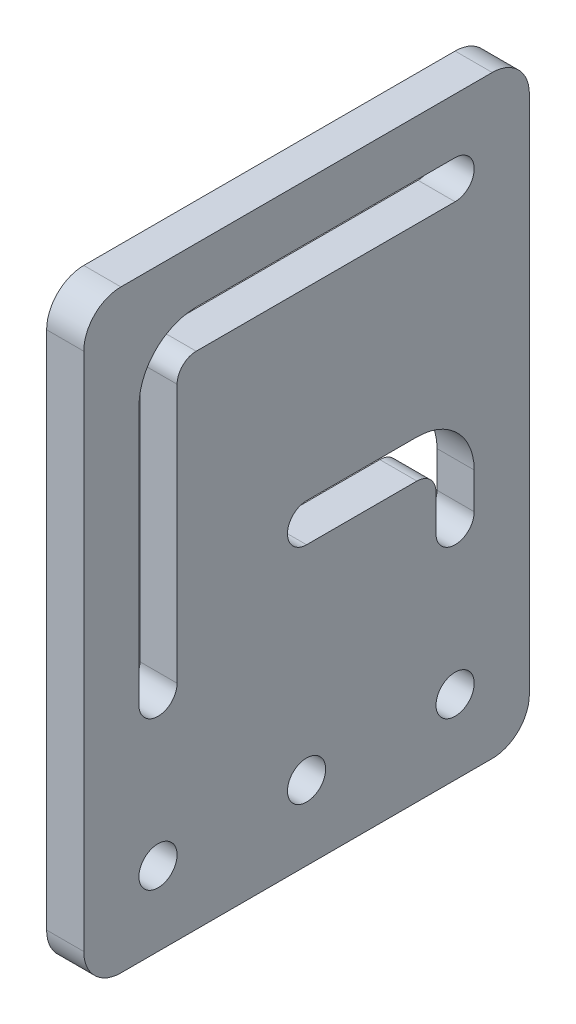
ISO-10303-21;
HEADER;
FILE_DESCRIPTION(('STEP AP214'),'2;1');
FILE_NAME('part.step','',(''),(''),'','','');
FILE_SCHEMA(('AUTOMOTIVE_DESIGN { 1 0 10303 214 1 1 1 1 }'));
ENDSEC;
DATA;
#1=APPLICATION_CONTEXT('core data for automotive mechanical design processes');
#2=APPLICATION_PROTOCOL_DEFINITION('international standard','automotive_design',2000,#1);
#3=PRODUCT_CONTEXT('',#1,'mechanical');
#4=PRODUCT('Part','Part','',(#3));
#5=PRODUCT_RELATED_PRODUCT_CATEGORY('part','',(#4));
#6=PRODUCT_DEFINITION_FORMATION('','',#4);
#7=PRODUCT_DEFINITION_CONTEXT('part definition',#1,'design');
#8=PRODUCT_DEFINITION('design','',#6,#7);
#9=PRODUCT_DEFINITION_SHAPE('','',#8);
#10=(LENGTH_UNIT() NAMED_UNIT(*) SI_UNIT(.MILLI.,.METRE.));
#11=(NAMED_UNIT(*) PLANE_ANGLE_UNIT() SI_UNIT($,.RADIAN.));
#12=(NAMED_UNIT(*) SI_UNIT($,.STERADIAN.) SOLID_ANGLE_UNIT());
#13=UNCERTAINTY_MEASURE_WITH_UNIT(LENGTH_MEASURE(1.E-05),#10,'distance_accuracy_value','');
#14=(GEOMETRIC_REPRESENTATION_CONTEXT(3) GLOBAL_UNCERTAINTY_ASSIGNED_CONTEXT((#13)) GLOBAL_UNIT_ASSIGNED_CONTEXT((#10,
#11,#12)) REPRESENTATION_CONTEXT('',''));
#15=CARTESIAN_POINT('',(0.,0.,0.));
#16=DIRECTION('',(0.,0.,1.));
#17=DIRECTION('',(1.,0.,0.));
#18=AXIS2_PLACEMENT_3D('',#15,#16,#17);
#19=CARTESIAN_POINT('',(6.35,101.6,0.));
#20=DIRECTION('',(-1.,0.,0.));
#21=DIRECTION('',(0.,0.,1.));
#22=AXIS2_PLACEMENT_3D('',#19,#20,#21);
#23=PLANE('',#22);
#24=DIRECTION('',(0.,-1.,0.));
#25=VECTOR('',#24,1.);
#26=CARTESIAN_POINT('',(6.35,47.5360999999999,-60.2360999999999));
#27=LINE('',#26,#25);
#28=CARTESIAN_POINT('',(6.35,44.2721999999999,-60.2360999999999));
#29=VERTEX_POINT('',#28);
#30=CARTESIAN_POINT('',(6.35,38.0999999999999,-60.2360999999999));
#31=VERTEX_POINT('',#30);
#32=EDGE_CURVE('E268',#29,#31,#27,.T.);
#33=ORIENTED_EDGE('',*,*,#32,.F.);
#34=CARTESIAN_POINT('',(6.35,44.2721999999999,-56.9721999999999));
#35=DIRECTION('',(-1.,0.,0.));
#36=DIRECTION('',(0.,0.,1.));
#37=AXIS2_PLACEMENT_3D('',#34,#35,#36);
#38=CIRCLE('',#37,3.2639);
#39=CARTESIAN_POINT('',(6.35,47.5360999999999,-56.9721999999999));
#40=VERTEX_POINT('',#39);
#41=EDGE_CURVE('E334',#29,#40,#38,.F.);
#42=ORIENTED_EDGE('',*,*,#41,.T.);
#43=DIRECTION('',(0.,0.,-1.));
#44=VECTOR('',#43,1.);
#45=CARTESIAN_POINT('',(6.35,47.5361,-38.1));
#46=LINE('',#45,#44);
#47=CARTESIAN_POINT('',(6.35,47.5361,-38.1));
#48=VERTEX_POINT('',#47);
#49=EDGE_CURVE('E265',#48,#40,#46,.T.);
#50=ORIENTED_EDGE('',*,*,#49,.F.);
#51=CARTESIAN_POINT('',(6.35,50.8,-38.1));
#52=DIRECTION('',(1.,0.,0.));
#53=DIRECTION('',(0.,0.,-1.));
#54=AXIS2_PLACEMENT_3D('',#51,#52,#53);
#55=CIRCLE('',#54,3.2639);
#56=CARTESIAN_POINT('',(6.35,54.0639,-38.1));
#57=VERTEX_POINT('',#56);
#58=EDGE_CURVE('E263',#57,#48,#55,.T.);
#59=ORIENTED_EDGE('',*,*,#58,.F.);
#60=DIRECTION('',(0.,0.,1.));
#61=VECTOR('',#60,1.);
#62=CARTESIAN_POINT('',(6.35,54.0639,-38.1));
#63=LINE('',#62,#61);
#64=CARTESIAN_POINT('',(6.35,54.0638999999999,-56.9721999999999));
#65=VERTEX_POINT('',#64);
#66=EDGE_CURVE('E275',#65,#57,#63,.T.);
#67=ORIENTED_EDGE('',*,*,#66,.F.);
#68=CARTESIAN_POINT('',(6.35,44.2721999999999,-56.9721999999999));
#69=DIRECTION('',(-1.,0.,0.));
#70=DIRECTION('',(0.,0.,1.));
#71=AXIS2_PLACEMENT_3D('',#68,#69,#70);
#72=CIRCLE('',#71,9.7917);
#73=CARTESIAN_POINT('',(6.35,44.2721999999999,-66.7638999999999));
#74=VERTEX_POINT('',#73);
#75=EDGE_CURVE('E359',#65,#74,#72,.T.);
#76=ORIENTED_EDGE('',*,*,#75,.T.);
#77=DIRECTION('',(0.,1.,0.));
#78=VECTOR('',#77,1.);
#79=CARTESIAN_POINT('',(6.35,54.0638999999999,-66.7638999999999));
#80=LINE('',#79,#78);
#81=CARTESIAN_POINT('',(6.35,38.0999999999999,-66.7638999999999));
#82=VERTEX_POINT('',#81);
#83=EDGE_CURVE('E272',#82,#74,#80,.T.);
#84=ORIENTED_EDGE('',*,*,#83,.F.);
#85=CARTESIAN_POINT('',(6.35,38.1,-63.4999999999999));
#86=DIRECTION('',(1.,0.,0.));
#87=DIRECTION('',(0.,0.,-1.));
#88=AXIS2_PLACEMENT_3D('',#85,#86,#87);
#89=CIRCLE('',#88,3.26389999999998);
#90=EDGE_CURVE('E270',#31,#82,#89,.T.);
#91=ORIENTED_EDGE('',*,*,#90,.F.);
#92=EDGE_LOOP('',(#33,#42,#50,#59,#67,#76,#84,#91));
#93=FACE_BOUND('',#92,.T.);
#94=CARTESIAN_POINT('',(6.35,12.7,-38.1));
#95=DIRECTION('',(1.,0.,0.));
#96=DIRECTION('',(0.,0.,-1.));
#97=AXIS2_PLACEMENT_3D('',#94,#95,#96);
#98=CIRCLE('',#97,3.26390000000002);
#99=CARTESIAN_POINT('',(6.35,12.7,-41.3639));
#100=VERTEX_POINT('',#99);
#101=EDGE_CURVE('E297',#100,#100,#98,.T.);
#102=ORIENTED_EDGE('',*,*,#101,.F.);
#103=EDGE_LOOP('',(#102));
#104=FACE_BOUND('',#103,.T.);
#105=DIRECTION('',(0.,-1.,0.));
#106=VECTOR('',#105,1.);
#107=CARTESIAN_POINT('',(6.35,0.,0.));
#108=LINE('',#107,#106);
#109=CARTESIAN_POINT('',(6.35,95.25,0.));
#110=VERTEX_POINT('',#109);
#111=CARTESIAN_POINT('',(6.35,6.35,0.));
#112=VERTEX_POINT('',#111);
#113=EDGE_CURVE('E317',#110,#112,#108,.T.);
#114=ORIENTED_EDGE('',*,*,#113,.T.);
#115=CARTESIAN_POINT('',(6.35,6.35,-6.35));
#116=DIRECTION('',(-1.,0.,0.));
#117=DIRECTION('',(0.,0.,1.));
#118=AXIS2_PLACEMENT_3D('',#115,#116,#117);
#119=CIRCLE('',#118,6.35);
#120=CARTESIAN_POINT('',(6.35,0.,-6.35));
#121=VERTEX_POINT('',#120);
#122=EDGE_CURVE('E384',#112,#121,#119,.F.);
#123=ORIENTED_EDGE('',*,*,#122,.T.);
#124=DIRECTION('',(0.,0.,-1.));
#125=VECTOR('',#124,1.);
#126=CARTESIAN_POINT('',(6.35,0.,0.));
#127=LINE('',#126,#125);
#128=CARTESIAN_POINT('',(6.35,0.,-69.85));
#129=VERTEX_POINT('',#128);
#130=EDGE_CURVE('E320',#121,#129,#127,.T.);
#131=ORIENTED_EDGE('',*,*,#130,.T.);
#132=CARTESIAN_POINT('',(6.35,6.35,-69.85));
#133=DIRECTION('',(-1.,0.,0.));
#134=DIRECTION('',(0.,0.,1.));
#135=AXIS2_PLACEMENT_3D('',#132,#133,#134);
#136=CIRCLE('',#135,6.35);
#137=CARTESIAN_POINT('',(6.35,6.35,-76.2));
#138=VERTEX_POINT('',#137);
#139=EDGE_CURVE('E382',#129,#138,#136,.F.);
#140=ORIENTED_EDGE('',*,*,#139,.T.);
#141=DIRECTION('',(0.,1.,0.));
#142=VECTOR('',#141,1.);
#143=CARTESIAN_POINT('',(6.35,0.,-76.2));
#144=LINE('',#143,#142);
#145=CARTESIAN_POINT('',(6.35,95.25,-76.2));
#146=VERTEX_POINT('',#145);
#147=EDGE_CURVE('E323',#138,#146,#144,.T.);
#148=ORIENTED_EDGE('',*,*,#147,.T.);
#149=CARTESIAN_POINT('',(6.35,95.25,-69.85));
#150=DIRECTION('',(-1.,0.,0.));
#151=DIRECTION('',(0.,0.,1.));
#152=AXIS2_PLACEMENT_3D('',#149,#150,#151);
#153=CIRCLE('',#152,6.35);
#154=CARTESIAN_POINT('',(6.35,101.6,-69.85));
#155=VERTEX_POINT('',#154);
#156=EDGE_CURVE('E52',#146,#155,#153,.F.);
#157=ORIENTED_EDGE('',*,*,#156,.T.);
#158=DIRECTION('',(0.,0.,1.));
#159=VECTOR('',#158,1.);
#160=CARTESIAN_POINT('',(6.35,101.6,0.));
#161=LINE('',#160,#159);
#162=CARTESIAN_POINT('',(6.35,101.6,-6.34999999999999));
#163=VERTEX_POINT('',#162);
#164=EDGE_CURVE('E325',#155,#163,#161,.T.);
#165=ORIENTED_EDGE('',*,*,#164,.T.);
#166=CARTESIAN_POINT('',(6.35,95.25,-6.34999999999999));
#167=DIRECTION('',(-1.,0.,0.));
#168=DIRECTION('',(0.,0.,1.));
#169=AXIS2_PLACEMENT_3D('',#166,#167,#168);
#170=CIRCLE('',#169,6.35);
#171=EDGE_CURVE('E379',#163,#110,#170,.F.);
#172=ORIENTED_EDGE('',*,*,#171,.T.);
#173=EDGE_LOOP('',(#114,#123,#131,#140,#148,#157,#165,#172));
#174=FACE_BOUND('',#173,.T.);
#175=CARTESIAN_POINT('',(6.35,12.7,-12.7));
#176=DIRECTION('',(1.,0.,0.));
#177=DIRECTION('',(0.,0.,-1.));
#178=AXIS2_PLACEMENT_3D('',#175,#176,#177);
#179=CIRCLE('',#178,3.2639);
#180=CARTESIAN_POINT('',(6.35,12.7,-15.9639));
#181=VERTEX_POINT('',#180);
#182=EDGE_CURVE('E303',#181,#181,#179,.T.);
#183=ORIENTED_EDGE('',*,*,#182,.F.);
#184=EDGE_LOOP('',(#183));
#185=FACE_BOUND('',#184,.T.);
#186=CARTESIAN_POINT('',(6.35,12.7,-63.5));
#187=DIRECTION('',(1.,0.,0.));
#188=DIRECTION('',(0.,0.,-1.));
#189=AXIS2_PLACEMENT_3D('',#186,#187,#188);
#190=CIRCLE('',#189,3.26389999999999);
#191=CARTESIAN_POINT('',(6.35,12.7,-66.7639));
#192=VERTEX_POINT('',#191);
#193=EDGE_CURVE('E291',#192,#192,#190,.T.);
#194=ORIENTED_EDGE('',*,*,#193,.F.);
#195=EDGE_LOOP('',(#194));
#196=FACE_BOUND('',#195,.T.);
#197=DIRECTION('',(0.,0.,-1.));
#198=VECTOR('',#197,1.);
#199=CARTESIAN_POINT('',(6.35,85.6360999999999,-15.9639));
#200=LINE('',#199,#198);
#201=CARTESIAN_POINT('',(6.35,85.6360999999999,-19.2278));
#202=VERTEX_POINT('',#201);
#203=CARTESIAN_POINT('',(6.35,85.6360999999999,-63.5));
#204=VERTEX_POINT('',#203);
#205=EDGE_CURVE('E233',#202,#204,#200,.T.);
#206=ORIENTED_EDGE('',*,*,#205,.F.);
#207=CARTESIAN_POINT('',(6.35,82.3721999999999,-19.2278));
#208=DIRECTION('',(-1.,0.,0.));
#209=DIRECTION('',(0.,0.,1.));
#210=AXIS2_PLACEMENT_3D('',#207,#208,#209);
#211=CIRCLE('',#210,3.2639);
#212=CARTESIAN_POINT('',(6.35,82.3721999999999,-15.9639));
#213=VERTEX_POINT('',#212);
#214=EDGE_CURVE('E336',#202,#213,#211,.F.);
#215=ORIENTED_EDGE('',*,*,#214,.T.);
#216=DIRECTION('',(0.,1.,0.));
#217=VECTOR('',#216,1.);
#218=CARTESIAN_POINT('',(6.35,38.1,-15.9639));
#219=LINE('',#218,#217);
#220=CARTESIAN_POINT('',(6.35,38.1,-15.9639));
#221=VERTEX_POINT('',#220);
#222=EDGE_CURVE('E231',#221,#213,#219,.T.);
#223=ORIENTED_EDGE('',*,*,#222,.F.);
#224=CARTESIAN_POINT('',(6.35,38.1,-12.7));
#225=DIRECTION('',(1.,0.,0.));
#226=DIRECTION('',(0.,0.,-1.));
#227=AXIS2_PLACEMENT_3D('',#224,#225,#226);
#228=CIRCLE('',#227,3.2639);
#229=CARTESIAN_POINT('',(6.35,38.1,-9.43610000000004));
#230=VERTEX_POINT('',#229);
#231=EDGE_CURVE('E213',#230,#221,#228,.T.);
#232=ORIENTED_EDGE('',*,*,#231,.F.);
#233=DIRECTION('',(0.,-1.,0.));
#234=VECTOR('',#233,1.);
#235=CARTESIAN_POINT('',(6.35,38.1,-9.43610000000004));
#236=LINE('',#235,#234);
#237=CARTESIAN_POINT('',(6.35,82.3721999999999,-9.43610000000004));
#238=VERTEX_POINT('',#237);
#239=EDGE_CURVE('E240',#238,#230,#236,.T.);
#240=ORIENTED_EDGE('',*,*,#239,.F.);
#241=CARTESIAN_POINT('',(6.35,82.3721999999999,-19.2278));
#242=DIRECTION('',(-1.,0.,0.));
#243=DIRECTION('',(0.,0.,1.));
#244=AXIS2_PLACEMENT_3D('',#241,#242,#243);
#245=CIRCLE('',#244,9.7917);
#246=CARTESIAN_POINT('',(6.35,92.1638999999999,-19.2278));
#247=VERTEX_POINT('',#246);
#248=EDGE_CURVE('E355',#238,#247,#245,.T.);
#249=ORIENTED_EDGE('',*,*,#248,.T.);
#250=DIRECTION('',(0.,0.,1.));
#251=VECTOR('',#250,1.);
#252=CARTESIAN_POINT('',(6.35,92.1638999999999,-9.43610000000004));
#253=LINE('',#252,#251);
#254=CARTESIAN_POINT('',(6.35,92.1638999999999,-63.4999999999999));
#255=VERTEX_POINT('',#254);
#256=EDGE_CURVE('E237',#255,#247,#253,.T.);
#257=ORIENTED_EDGE('',*,*,#256,.F.);
#258=CARTESIAN_POINT('',(6.35,88.8999999999999,-63.4999999999999));
#259=DIRECTION('',(1.,0.,0.));
#260=DIRECTION('',(0.,0.,-1.));
#261=AXIS2_PLACEMENT_3D('',#258,#259,#260);
#262=CIRCLE('',#261,3.26389999999999);
#263=EDGE_CURVE('E235',#204,#255,#262,.T.);
#264=ORIENTED_EDGE('',*,*,#263,.F.);
#265=EDGE_LOOP('',(#206,#215,#223,#232,#240,#249,#257,#264));
#266=FACE_BOUND('',#265,.T.);
#267=ADVANCED_FACE('F31',(#93,#104,#174,#185,#196,#266),#23,.F.);
#268=CARTESIAN_POINT('',(0.,101.6,0.));
#269=DIRECTION('',(-1.,0.,0.));
#270=DIRECTION('',(0.,0.,1.));
#271=AXIS2_PLACEMENT_3D('',#268,#269,#270);
#272=PLANE('',#271);
#273=DIRECTION('',(0.,0.,-1.));
#274=VECTOR('',#273,1.);
#275=CARTESIAN_POINT('',(0.,47.5361,-38.1));
#276=LINE('',#275,#274);
#277=CARTESIAN_POINT('',(0.,47.5361,-38.1));
#278=VERTEX_POINT('',#277);
#279=CARTESIAN_POINT('',(0.,47.5360999999999,-56.9721999999999));
#280=VERTEX_POINT('',#279);
#281=EDGE_CURVE('E250',#278,#280,#276,.T.);
#282=ORIENTED_EDGE('',*,*,#281,.T.);
#283=CARTESIAN_POINT('',(0.,44.2721999999999,-56.9721999999999));
#284=DIRECTION('',(-1.,0.,0.));
#285=DIRECTION('',(0.,0.,1.));
#286=AXIS2_PLACEMENT_3D('',#283,#284,#285);
#287=CIRCLE('',#286,3.2639);
#288=CARTESIAN_POINT('',(0.,44.2721999999999,-60.2360999999999));
#289=VERTEX_POINT('',#288);
#290=EDGE_CURVE('E328',#280,#289,#287,.T.);
#291=ORIENTED_EDGE('',*,*,#290,.T.);
#292=DIRECTION('',(0.,-1.,0.));
#293=VECTOR('',#292,1.);
#294=CARTESIAN_POINT('',(0.,47.5360999999999,-60.2360999999999));
#295=LINE('',#294,#293);
#296=CARTESIAN_POINT('',(0.,38.0999999999999,-60.2360999999999));
#297=VERTEX_POINT('',#296);
#298=EDGE_CURVE('E253',#289,#297,#295,.T.);
#299=ORIENTED_EDGE('',*,*,#298,.T.);
#300=CARTESIAN_POINT('',(0.,38.1,-63.4999999999999));
#301=DIRECTION('',(1.,0.,0.));
#302=DIRECTION('',(0.,0.,-1.));
#303=AXIS2_PLACEMENT_3D('',#300,#301,#302);
#304=CIRCLE('',#303,3.26389999999998);
#305=CARTESIAN_POINT('',(0.,38.0999999999999,-66.7638999999999));
#306=VERTEX_POINT('',#305);
#307=EDGE_CURVE('E255',#297,#306,#304,.T.);
#308=ORIENTED_EDGE('',*,*,#307,.T.);
#309=DIRECTION('',(0.,1.,0.));
#310=VECTOR('',#309,1.);
#311=CARTESIAN_POINT('',(0.,54.0638999999999,-66.7638999999999));
#312=LINE('',#311,#310);
#313=CARTESIAN_POINT('',(0.,44.2721999999999,-66.7638999999999));
#314=VERTEX_POINT('',#313);
#315=EDGE_CURVE('E258',#306,#314,#312,.T.);
#316=ORIENTED_EDGE('',*,*,#315,.T.);
#317=CARTESIAN_POINT('',(0.,44.2721999999999,-56.9721999999999));
#318=DIRECTION('',(-1.,0.,0.));
#319=DIRECTION('',(0.,0.,1.));
#320=AXIS2_PLACEMENT_3D('',#317,#318,#319);
#321=CIRCLE('',#320,9.7917);
#322=CARTESIAN_POINT('',(0.,54.0638999999999,-56.9721999999999));
#323=VERTEX_POINT('',#322);
#324=EDGE_CURVE('E357',#314,#323,#321,.F.);
#325=ORIENTED_EDGE('',*,*,#324,.T.);
#326=DIRECTION('',(0.,0.,1.));
#327=VECTOR('',#326,1.);
#328=CARTESIAN_POINT('',(0.,54.0639,-38.1));
#329=LINE('',#328,#327);
#330=CARTESIAN_POINT('',(0.,54.0639,-38.1));
#331=VERTEX_POINT('',#330);
#332=EDGE_CURVE('E261',#323,#331,#329,.T.);
#333=ORIENTED_EDGE('',*,*,#332,.T.);
#334=CARTESIAN_POINT('',(0.,50.8,-38.1));
#335=DIRECTION('',(1.,0.,0.));
#336=DIRECTION('',(0.,0.,-1.));
#337=AXIS2_PLACEMENT_3D('',#334,#335,#336);
#338=CIRCLE('',#337,3.2639);
#339=EDGE_CURVE('E214',#331,#278,#338,.T.);
#340=ORIENTED_EDGE('',*,*,#339,.T.);
#341=EDGE_LOOP('',(#282,#291,#299,#308,#316,#325,#333,#340));
#342=FACE_BOUND('',#341,.T.);
#343=CARTESIAN_POINT('',(0.,12.7,-38.1));
#344=DIRECTION('',(1.,0.,0.));
#345=DIRECTION('',(0.,0.,-1.));
#346=AXIS2_PLACEMENT_3D('',#343,#344,#345);
#347=CIRCLE('',#346,3.26390000000002);
#348=CARTESIAN_POINT('',(0.,12.7,-41.3639));
#349=VERTEX_POINT('',#348);
#350=EDGE_CURVE('E294',#349,#349,#347,.T.);
#351=ORIENTED_EDGE('',*,*,#350,.T.);
#352=EDGE_LOOP('',(#351));
#353=FACE_BOUND('',#352,.T.);
#354=DIRECTION('',(0.,0.,-1.));
#355=VECTOR('',#354,1.);
#356=CARTESIAN_POINT('',(0.,0.,0.));
#357=LINE('',#356,#355);
#358=CARTESIAN_POINT('',(0.,0.,-6.35));
#359=VERTEX_POINT('',#358);
#360=CARTESIAN_POINT('',(0.,0.,-69.85));
#361=VERTEX_POINT('',#360);
#362=EDGE_CURVE('E309',#359,#361,#357,.T.);
#363=ORIENTED_EDGE('',*,*,#362,.F.);
#364=CARTESIAN_POINT('',(0.,6.35,-6.35));
#365=DIRECTION('',(-1.,0.,0.));
#366=DIRECTION('',(0.,0.,1.));
#367=AXIS2_PLACEMENT_3D('',#364,#365,#366);
#368=CIRCLE('',#367,6.35);
#369=CARTESIAN_POINT('',(0.,6.35,0.));
#370=VERTEX_POINT('',#369);
#371=EDGE_CURVE('E372',#359,#370,#368,.T.);
#372=ORIENTED_EDGE('',*,*,#371,.T.);
#373=DIRECTION('',(0.,-1.,0.));
#374=VECTOR('',#373,1.);
#375=CARTESIAN_POINT('',(0.,0.,0.));
#376=LINE('',#375,#374);
#377=CARTESIAN_POINT('',(0.,95.25,0.));
#378=VERTEX_POINT('',#377);
#379=EDGE_CURVE('E306',#378,#370,#376,.T.);
#380=ORIENTED_EDGE('',*,*,#379,.F.);
#381=CARTESIAN_POINT('',(0.,95.25,-6.34999999999999));
#382=DIRECTION('',(-1.,0.,0.));
#383=DIRECTION('',(0.,0.,1.));
#384=AXIS2_PLACEMENT_3D('',#381,#382,#383);
#385=CIRCLE('',#384,6.35);
#386=CARTESIAN_POINT('',(0.,101.6,-6.34999999999999));
#387=VERTEX_POINT('',#386);
#388=EDGE_CURVE('E366',#378,#387,#385,.T.);
#389=ORIENTED_EDGE('',*,*,#388,.T.);
#390=DIRECTION('',(0.,0.,1.));
#391=VECTOR('',#390,1.);
#392=CARTESIAN_POINT('',(0.,101.6,0.));
#393=LINE('',#392,#391);
#394=CARTESIAN_POINT('',(0.,101.6,-69.85));
#395=VERTEX_POINT('',#394);
#396=EDGE_CURVE('E315',#395,#387,#393,.T.);
#397=ORIENTED_EDGE('',*,*,#396,.F.);
#398=CARTESIAN_POINT('',(0.,95.25,-69.85));
#399=DIRECTION('',(-1.,0.,0.));
#400=DIRECTION('',(0.,0.,1.));
#401=AXIS2_PLACEMENT_3D('',#398,#399,#400);
#402=CIRCLE('',#401,6.35);
#403=CARTESIAN_POINT('',(0.,95.25,-76.2));
#404=VERTEX_POINT('',#403);
#405=EDGE_CURVE('E368',#395,#404,#402,.T.);
#406=ORIENTED_EDGE('',*,*,#405,.T.);
#407=DIRECTION('',(0.,1.,0.));
#408=VECTOR('',#407,1.);
#409=CARTESIAN_POINT('',(0.,0.,-76.2));
#410=LINE('',#409,#408);
#411=CARTESIAN_POINT('',(0.,6.35,-76.2));
#412=VERTEX_POINT('',#411);
#413=EDGE_CURVE('E312',#412,#404,#410,.T.);
#414=ORIENTED_EDGE('',*,*,#413,.F.);
#415=CARTESIAN_POINT('',(0.,6.35,-69.85));
#416=DIRECTION('',(-1.,0.,0.));
#417=DIRECTION('',(0.,0.,1.));
#418=AXIS2_PLACEMENT_3D('',#415,#416,#417);
#419=CIRCLE('',#418,6.35);
#420=EDGE_CURVE('E370',#412,#361,#419,.T.);
#421=ORIENTED_EDGE('',*,*,#420,.T.);
#422=EDGE_LOOP('',(#363,#372,#380,#389,#397,#406,#414,#421));
#423=FACE_BOUND('',#422,.T.);
#424=CARTESIAN_POINT('',(0.,12.7,-12.7));
#425=DIRECTION('',(1.,0.,0.));
#426=DIRECTION('',(0.,0.,-1.));
#427=AXIS2_PLACEMENT_3D('',#424,#425,#426);
#428=CIRCLE('',#427,3.2639);
#429=CARTESIAN_POINT('',(0.,12.7,-15.9639));
#430=VERTEX_POINT('',#429);
#431=EDGE_CURVE('E300',#430,#430,#428,.T.);
#432=ORIENTED_EDGE('',*,*,#431,.T.);
#433=EDGE_LOOP('',(#432));
#434=FACE_BOUND('',#433,.T.);
#435=CARTESIAN_POINT('',(0.,12.7,-63.5));
#436=DIRECTION('',(1.,0.,0.));
#437=DIRECTION('',(0.,0.,-1.));
#438=AXIS2_PLACEMENT_3D('',#435,#436,#437);
#439=CIRCLE('',#438,3.26389999999999);
#440=CARTESIAN_POINT('',(0.,12.7,-66.7639));
#441=VERTEX_POINT('',#440);
#442=EDGE_CURVE('E288',#441,#441,#439,.T.);
#443=ORIENTED_EDGE('',*,*,#442,.T.);
#444=EDGE_LOOP('',(#443));
#445=FACE_BOUND('',#444,.T.);
#446=DIRECTION('',(0.,1.,0.));
#447=VECTOR('',#446,1.);
#448=CARTESIAN_POINT('',(0.,38.1,-15.9639));
#449=LINE('',#448,#447);
#450=CARTESIAN_POINT('',(0.,38.1,-15.9639));
#451=VERTEX_POINT('',#450);
#452=CARTESIAN_POINT('',(0.,82.3721999999999,-15.9639));
#453=VERTEX_POINT('',#452);
#454=EDGE_CURVE('E194',#451,#453,#449,.T.);
#455=ORIENTED_EDGE('',*,*,#454,.T.);
#456=CARTESIAN_POINT('',(0.,82.3721999999999,-19.2278));
#457=DIRECTION('',(-1.,0.,0.));
#458=DIRECTION('',(0.,0.,1.));
#459=AXIS2_PLACEMENT_3D('',#456,#457,#458);
#460=CIRCLE('',#459,3.2639);
#461=CARTESIAN_POINT('',(0.,85.6360999999999,-19.2278));
#462=VERTEX_POINT('',#461);
#463=EDGE_CURVE('E330',#453,#462,#460,.T.);
#464=ORIENTED_EDGE('',*,*,#463,.T.);
#465=DIRECTION('',(0.,0.,-1.));
#466=VECTOR('',#465,1.);
#467=CARTESIAN_POINT('',(0.,85.6360999999999,-15.9639));
#468=LINE('',#467,#466);
#469=CARTESIAN_POINT('',(0.,85.6360999999999,-63.5));
#470=VERTEX_POINT('',#469);
#471=EDGE_CURVE('E204',#462,#470,#468,.T.);
#472=ORIENTED_EDGE('',*,*,#471,.T.);
#473=CARTESIAN_POINT('',(0.,88.8999999999999,-63.4999999999999));
#474=DIRECTION('',(1.,0.,0.));
#475=DIRECTION('',(0.,0.,-1.));
#476=AXIS2_PLACEMENT_3D('',#473,#474,#475);
#477=CIRCLE('',#476,3.26389999999999);
#478=CARTESIAN_POINT('',(0.,92.1638999999999,-63.4999999999999));
#479=VERTEX_POINT('',#478);
#480=EDGE_CURVE('E223',#470,#479,#477,.T.);
#481=ORIENTED_EDGE('',*,*,#480,.T.);
#482=DIRECTION('',(0.,0.,1.));
#483=VECTOR('',#482,1.);
#484=CARTESIAN_POINT('',(0.,92.1638999999999,-9.43610000000004));
#485=LINE('',#484,#483);
#486=CARTESIAN_POINT('',(0.,92.1638999999999,-19.2278));
#487=VERTEX_POINT('',#486);
#488=EDGE_CURVE('E226',#479,#487,#485,.T.);
#489=ORIENTED_EDGE('',*,*,#488,.T.);
#490=CARTESIAN_POINT('',(0.,82.3721999999999,-19.2278));
#491=DIRECTION('',(-1.,0.,0.));
#492=DIRECTION('',(0.,0.,1.));
#493=AXIS2_PLACEMENT_3D('',#490,#491,#492);
#494=CIRCLE('',#493,9.7917);
#495=CARTESIAN_POINT('',(0.,82.3721999999999,-9.43610000000004));
#496=VERTEX_POINT('',#495);
#497=EDGE_CURVE('E353',#487,#496,#494,.F.);
#498=ORIENTED_EDGE('',*,*,#497,.T.);
#499=DIRECTION('',(0.,-1.,0.));
#500=VECTOR('',#499,1.);
#501=CARTESIAN_POINT('',(0.,38.1,-9.43610000000004));
#502=LINE('',#501,#500);
#503=CARTESIAN_POINT('',(0.,38.1,-9.43610000000004));
#504=VERTEX_POINT('',#503);
#505=EDGE_CURVE('E219',#496,#504,#502,.T.);
#506=ORIENTED_EDGE('',*,*,#505,.T.);
#507=CARTESIAN_POINT('',(0.,38.1,-12.7));
#508=DIRECTION('',(1.,0.,0.));
#509=DIRECTION('',(0.,0.,-1.));
#510=AXIS2_PLACEMENT_3D('',#507,#508,#509);
#511=CIRCLE('',#510,3.2639);
#512=EDGE_CURVE('E205',#504,#451,#511,.T.);
#513=ORIENTED_EDGE('',*,*,#512,.T.);
#514=EDGE_LOOP('',(#455,#464,#472,#481,#489,#498,#506,#513));
#515=FACE_BOUND('',#514,.T.);
#516=ADVANCED_FACE('F217',(#342,#353,#423,#434,#445,#515),#272,.T.);
#517=CARTESIAN_POINT('',(6.35,0.,0.));
#518=DIRECTION('',(0.,0.,-1.));
#519=DIRECTION('',(0.,1.,0.));
#520=AXIS2_PLACEMENT_3D('',#517,#518,#519);
#521=PLANE('',#520);
#522=ORIENTED_EDGE('',*,*,#379,.T.);
#523=DIRECTION('',(-1.,0.,0.));
#524=VECTOR('',#523,1.);
#525=CARTESIAN_POINT('',(6.35,6.35,0.));
#526=LINE('',#525,#524);
#527=EDGE_CURVE('E377',#370,#112,#526,.F.);
#528=ORIENTED_EDGE('',*,*,#527,.T.);
#529=ORIENTED_EDGE('',*,*,#113,.F.);
#530=DIRECTION('',(-1.,0.,0.));
#531=VECTOR('',#530,1.);
#532=CARTESIAN_POINT('',(6.35,95.25,0.));
#533=LINE('',#532,#531);
#534=EDGE_CURVE('E374',#110,#378,#533,.T.);
#535=ORIENTED_EDGE('',*,*,#534,.T.);
#536=EDGE_LOOP('',(#522,#528,#529,#535));
#537=FACE_BOUND('',#536,.T.);
#538=ADVANCED_FACE('F33',(#537),#521,.F.);
#539=CARTESIAN_POINT('',(6.35,0.,0.));
#540=DIRECTION('',(0.,1.,0.));
#541=DIRECTION('',(0.,0.,1.));
#542=AXIS2_PLACEMENT_3D('',#539,#540,#541);
#543=PLANE('',#542);
#544=ORIENTED_EDGE('',*,*,#130,.F.);
#545=DIRECTION('',(-1.,0.,0.));
#546=VECTOR('',#545,1.);
#547=CARTESIAN_POINT('',(6.35,0.,-6.35));
#548=LINE('',#547,#546);
#549=EDGE_CURVE('E363',#121,#359,#548,.T.);
#550=ORIENTED_EDGE('',*,*,#549,.T.);
#551=ORIENTED_EDGE('',*,*,#362,.T.);
#552=DIRECTION('',(-1.,0.,0.));
#553=VECTOR('',#552,1.);
#554=CARTESIAN_POINT('',(6.35,0.,-69.85));
#555=LINE('',#554,#553);
#556=EDGE_CURVE('E361',#361,#129,#555,.F.);
#557=ORIENTED_EDGE('',*,*,#556,.T.);
#558=EDGE_LOOP('',(#544,#550,#551,#557));
#559=FACE_BOUND('',#558,.T.);
#560=ADVANCED_FACE('F421',(#559),#543,.F.);
#561=CARTESIAN_POINT('',(6.35,0.,-76.2));
#562=DIRECTION('',(0.,0.,1.));
#563=DIRECTION('',(1.,0.,0.));
#564=AXIS2_PLACEMENT_3D('',#561,#562,#563);
#565=PLANE('',#564);
#566=ORIENTED_EDGE('',*,*,#147,.F.);
#567=DIRECTION('',(-1.,0.,0.));
#568=VECTOR('',#567,1.);
#569=CARTESIAN_POINT('',(6.35,6.35,-76.2));
#570=LINE('',#569,#568);
#571=EDGE_CURVE('E388',#138,#412,#570,.T.);
#572=ORIENTED_EDGE('',*,*,#571,.T.);
#573=ORIENTED_EDGE('',*,*,#413,.T.);
#574=DIRECTION('',(-1.,0.,0.));
#575=VECTOR('',#574,1.);
#576=CARTESIAN_POINT('',(6.35,95.25,-76.2));
#577=LINE('',#576,#575);
#578=EDGE_CURVE('E386',#404,#146,#577,.F.);
#579=ORIENTED_EDGE('',*,*,#578,.T.);
#580=EDGE_LOOP('',(#566,#572,#573,#579));
#581=FACE_BOUND('',#580,.T.);
#582=ADVANCED_FACE('F394',(#581),#565,.F.);
#583=CARTESIAN_POINT('',(6.35,101.6,0.));
#584=DIRECTION('',(0.,-1.,0.));
#585=DIRECTION('',(0.,0.,-1.));
#586=AXIS2_PLACEMENT_3D('',#583,#584,#585);
#587=PLANE('',#586);
#588=ORIENTED_EDGE('',*,*,#164,.F.);
#589=DIRECTION('',(-1.,0.,0.));
#590=VECTOR('',#589,1.);
#591=CARTESIAN_POINT('',(6.35,101.6,-69.85));
#592=LINE('',#591,#590);
#593=EDGE_CURVE('E11',#155,#395,#592,.T.);
#594=ORIENTED_EDGE('',*,*,#593,.T.);
#595=ORIENTED_EDGE('',*,*,#396,.T.);
#596=DIRECTION('',(-1.,0.,0.));
#597=VECTOR('',#596,1.);
#598=CARTESIAN_POINT('',(6.35,101.6,-6.34999999999999));
#599=LINE('',#598,#597);
#600=EDGE_CURVE('E39',#387,#163,#599,.F.);
#601=ORIENTED_EDGE('',*,*,#600,.T.);
#602=EDGE_LOOP('',(#588,#594,#595,#601));
#603=FACE_BOUND('',#602,.T.);
#604=ADVANCED_FACE('F405',(#603),#587,.F.);
#605=CARTESIAN_POINT('',(6.35,12.7,-12.7));
#606=DIRECTION('',(-1.,0.,0.));
#607=DIRECTION('',(0.,0.,1.));
#608=AXIS2_PLACEMENT_3D('',#605,#606,#607);
#609=CYLINDRICAL_SURFACE('',#608,3.2639);
#610=ORIENTED_EDGE('',*,*,#182,.T.);
#611=EDGE_LOOP('',(#610));
#612=FACE_BOUND('',#611,.T.);
#613=ORIENTED_EDGE('',*,*,#431,.F.);
#614=EDGE_LOOP('',(#613));
#615=FACE_BOUND('',#614,.T.);
#616=ADVANCED_FACE('F447',(#612,#615),#609,.F.);
#617=CARTESIAN_POINT('',(6.35,12.7,-38.1));
#618=DIRECTION('',(-1.,0.,0.));
#619=DIRECTION('',(0.,0.,1.));
#620=AXIS2_PLACEMENT_3D('',#617,#618,#619);
#621=CYLINDRICAL_SURFACE('',#620,3.26390000000002);
#622=ORIENTED_EDGE('',*,*,#101,.T.);
#623=EDGE_LOOP('',(#622));
#624=FACE_BOUND('',#623,.T.);
#625=ORIENTED_EDGE('',*,*,#350,.F.);
#626=EDGE_LOOP('',(#625));
#627=FACE_BOUND('',#626,.T.);
#628=ADVANCED_FACE('F629',(#624,#627),#621,.F.);
#629=CARTESIAN_POINT('',(6.35,12.7,-63.5));
#630=DIRECTION('',(-1.,0.,0.));
#631=DIRECTION('',(0.,0.,1.));
#632=AXIS2_PLACEMENT_3D('',#629,#630,#631);
#633=CYLINDRICAL_SURFACE('',#632,3.26389999999999);
#634=ORIENTED_EDGE('',*,*,#193,.T.);
#635=EDGE_LOOP('',(#634));
#636=FACE_BOUND('',#635,.T.);
#637=ORIENTED_EDGE('',*,*,#442,.F.);
#638=EDGE_LOOP('',(#637));
#639=FACE_BOUND('',#638,.T.);
#640=ADVANCED_FACE('F619',(#636,#639),#633,.F.);
#641=CARTESIAN_POINT('',(6.35,50.8,-38.1));
#642=DIRECTION('',(-1.,0.,0.));
#643=DIRECTION('',(0.,0.,1.));
#644=AXIS2_PLACEMENT_3D('',#641,#642,#643);
#645=CYLINDRICAL_SURFACE('',#644,3.2639);
#646=ORIENTED_EDGE('',*,*,#339,.F.);
#647=DIRECTION('',(-1.,0.,0.));
#648=VECTOR('',#647,1.);
#649=CARTESIAN_POINT('',(6.35,54.0639,-38.1));
#650=LINE('',#649,#648);
#651=EDGE_CURVE('E277',#57,#331,#650,.T.);
#652=ORIENTED_EDGE('',*,*,#651,.F.);
#653=ORIENTED_EDGE('',*,*,#58,.T.);
#654=DIRECTION('',(-1.,0.,0.));
#655=VECTOR('',#654,1.);
#656=CARTESIAN_POINT('',(6.35,47.5361,-38.1));
#657=LINE('',#656,#655);
#658=EDGE_CURVE('E285',#48,#278,#657,.T.);
#659=ORIENTED_EDGE('',*,*,#658,.T.);
#660=EDGE_LOOP('',(#646,#652,#653,#659));
#661=FACE_BOUND('',#660,.T.);
#662=ADVANCED_FACE('F589',(#661),#645,.F.);
#663=CARTESIAN_POINT('',(6.35,47.5361,-38.1));
#664=DIRECTION('',(0.,1.,0.));
#665=DIRECTION('',(0.,0.,1.));
#666=AXIS2_PLACEMENT_3D('',#663,#664,#665);
#667=PLANE('',#666);
#668=ORIENTED_EDGE('',*,*,#49,.T.);
#669=DIRECTION('',(-1.,0.,0.));
#670=VECTOR('',#669,1.);
#671=CARTESIAN_POINT('',(6.35,47.5360999999999,-56.9721999999999));
#672=LINE('',#671,#670);
#673=EDGE_CURVE('E338',#40,#280,#672,.T.);
#674=ORIENTED_EDGE('',*,*,#673,.T.);
#675=ORIENTED_EDGE('',*,*,#281,.F.);
#676=ORIENTED_EDGE('',*,*,#658,.F.);
#677=EDGE_LOOP('',(#668,#674,#675,#676));
#678=FACE_BOUND('',#677,.T.);
#679=ADVANCED_FACE('F579',(#678),#667,.T.);
#680=CARTESIAN_POINT('',(6.35,47.5360999999999,-60.2360999999999));
#681=DIRECTION('',(0.,0.,-1.));
#682=DIRECTION('',(0.,1.,0.));
#683=AXIS2_PLACEMENT_3D('',#680,#681,#682);
#684=PLANE('',#683);
#685=ORIENTED_EDGE('',*,*,#298,.F.);
#686=DIRECTION('',(-1.,0.,0.));
#687=VECTOR('',#686,1.);
#688=CARTESIAN_POINT('',(6.35,44.2721999999999,-60.2360999999999));
#689=LINE('',#688,#687);
#690=EDGE_CURVE('E341',#289,#29,#689,.F.);
#691=ORIENTED_EDGE('',*,*,#690,.T.);
#692=ORIENTED_EDGE('',*,*,#32,.T.);
#693=DIRECTION('',(-1.,0.,0.));
#694=VECTOR('',#693,1.);
#695=CARTESIAN_POINT('',(6.35,38.0999999999999,-60.2360999999999));
#696=LINE('',#695,#694);
#697=EDGE_CURVE('E282',#31,#297,#696,.T.);
#698=ORIENTED_EDGE('',*,*,#697,.T.);
#699=EDGE_LOOP('',(#685,#691,#692,#698));
#700=FACE_BOUND('',#699,.T.);
#701=ADVANCED_FACE('F574',(#700),#684,.T.);
#702=CARTESIAN_POINT('',(6.35,38.1,-63.4999999999999));
#703=DIRECTION('',(-1.,0.,0.));
#704=DIRECTION('',(0.,0.,1.));
#705=AXIS2_PLACEMENT_3D('',#702,#703,#704);
#706=CYLINDRICAL_SURFACE('',#705,3.26389999999998);
#707=ORIENTED_EDGE('',*,*,#307,.F.);
#708=ORIENTED_EDGE('',*,*,#697,.F.);
#709=ORIENTED_EDGE('',*,*,#90,.T.);
#710=DIRECTION('',(-1.,0.,0.));
#711=VECTOR('',#710,1.);
#712=CARTESIAN_POINT('',(6.35,38.0999999999999,-66.7638999999999));
#713=LINE('',#712,#711);
#714=EDGE_CURVE('E280',#82,#306,#713,.T.);
#715=ORIENTED_EDGE('',*,*,#714,.T.);
#716=EDGE_LOOP('',(#707,#708,#709,#715));
#717=FACE_BOUND('',#716,.T.);
#718=ADVANCED_FACE('F534',(#717),#706,.F.);
#719=CARTESIAN_POINT('',(6.35,54.0638999999999,-66.7638999999999));
#720=DIRECTION('',(0.,0.,1.));
#721=DIRECTION('',(0.,-1.,0.));
#722=AXIS2_PLACEMENT_3D('',#719,#720,#721);
#723=PLANE('',#722);
#724=ORIENTED_EDGE('',*,*,#83,.T.);
#725=DIRECTION('',(-1.,0.,0.));
#726=VECTOR('',#725,1.);
#727=CARTESIAN_POINT('',(0.,44.2721999999999,-66.7638999999999));
#728=LINE('',#727,#726);
#729=EDGE_CURVE('E348',#74,#314,#728,.T.);
#730=ORIENTED_EDGE('',*,*,#729,.T.);
#731=ORIENTED_EDGE('',*,*,#315,.F.);
#732=ORIENTED_EDGE('',*,*,#714,.F.);
#733=EDGE_LOOP('',(#724,#730,#731,#732));
#734=FACE_BOUND('',#733,.T.);
#735=ADVANCED_FACE('F522',(#734),#723,.T.);
#736=CARTESIAN_POINT('',(6.35,54.0639,-38.1));
#737=DIRECTION('',(0.,-1.,0.));
#738=DIRECTION('',(0.,0.,-1.));
#739=AXIS2_PLACEMENT_3D('',#736,#737,#738);
#740=PLANE('',#739);
#741=ORIENTED_EDGE('',*,*,#332,.F.);
#742=DIRECTION('',(-1.,0.,0.));
#743=VECTOR('',#742,1.);
#744=CARTESIAN_POINT('',(6.35,54.0638999999999,-56.9721999999999));
#745=LINE('',#744,#743);
#746=EDGE_CURVE('E351',#323,#65,#745,.F.);
#747=ORIENTED_EDGE('',*,*,#746,.T.);
#748=ORIENTED_EDGE('',*,*,#66,.T.);
#749=ORIENTED_EDGE('',*,*,#651,.T.);
#750=EDGE_LOOP('',(#741,#747,#748,#749));
#751=FACE_BOUND('',#750,.T.);
#752=ADVANCED_FACE('F517',(#751),#740,.T.);
#753=CARTESIAN_POINT('',(6.35,38.1,-12.7));
#754=DIRECTION('',(-1.,0.,0.));
#755=DIRECTION('',(0.,0.,1.));
#756=AXIS2_PLACEMENT_3D('',#753,#754,#755);
#757=CYLINDRICAL_SURFACE('',#756,3.2639);
#758=ORIENTED_EDGE('',*,*,#512,.F.);
#759=DIRECTION('',(-1.,0.,0.));
#760=VECTOR('',#759,1.);
#761=CARTESIAN_POINT('',(6.35,38.1,-9.43610000000004));
#762=LINE('',#761,#760);
#763=EDGE_CURVE('E242',#230,#504,#762,.T.);
#764=ORIENTED_EDGE('',*,*,#763,.F.);
#765=ORIENTED_EDGE('',*,*,#231,.T.);
#766=DIRECTION('',(-1.,0.,0.));
#767=VECTOR('',#766,1.);
#768=CARTESIAN_POINT('',(6.35,38.1,-15.9639));
#769=LINE('',#768,#767);
#770=EDGE_CURVE('E198',#221,#451,#769,.T.);
#771=ORIENTED_EDGE('',*,*,#770,.T.);
#772=EDGE_LOOP('',(#758,#764,#765,#771));
#773=FACE_BOUND('',#772,.T.);
#774=ADVANCED_FACE('F209',(#773),#757,.F.);
#775=CARTESIAN_POINT('',(6.35,38.1,-15.9639));
#776=DIRECTION('',(0.,0.,1.));
#777=DIRECTION('',(1.,0.,0.));
#778=AXIS2_PLACEMENT_3D('',#775,#776,#777);
#779=PLANE('',#778);
#780=ORIENTED_EDGE('',*,*,#222,.T.);
#781=DIRECTION('',(-1.,0.,0.));
#782=VECTOR('',#781,1.);
#783=CARTESIAN_POINT('',(6.35,82.3721999999999,-15.9639));
#784=LINE('',#783,#782);
#785=EDGE_CURVE('E201',#213,#453,#784,.T.);
#786=ORIENTED_EDGE('',*,*,#785,.T.);
#787=ORIENTED_EDGE('',*,*,#454,.F.);
#788=ORIENTED_EDGE('',*,*,#770,.F.);
#789=EDGE_LOOP('',(#780,#786,#787,#788));
#790=FACE_BOUND('',#789,.T.);
#791=ADVANCED_FACE('F197',(#790),#779,.T.);
#792=CARTESIAN_POINT('',(6.35,85.6360999999999,-15.9639));
#793=DIRECTION('',(0.,1.,0.));
#794=DIRECTION('',(0.,0.,1.));
#795=AXIS2_PLACEMENT_3D('',#792,#793,#794);
#796=PLANE('',#795);
#797=ORIENTED_EDGE('',*,*,#471,.F.);
#798=DIRECTION('',(-1.,0.,0.));
#799=VECTOR('',#798,1.);
#800=CARTESIAN_POINT('',(6.35,85.6360999999999,-19.2278));
#801=LINE('',#800,#799);
#802=EDGE_CURVE('E332',#462,#202,#801,.F.);
#803=ORIENTED_EDGE('',*,*,#802,.T.);
#804=ORIENTED_EDGE('',*,*,#205,.T.);
#805=DIRECTION('',(-1.,0.,0.));
#806=VECTOR('',#805,1.);
#807=CARTESIAN_POINT('',(6.35,85.6360999999999,-63.5));
#808=LINE('',#807,#806);
#809=EDGE_CURVE('E215',#204,#470,#808,.T.);
#810=ORIENTED_EDGE('',*,*,#809,.T.);
#811=EDGE_LOOP('',(#797,#803,#804,#810));
#812=FACE_BOUND('',#811,.T.);
#813=ADVANCED_FACE('F556',(#812),#796,.T.);
#814=CARTESIAN_POINT('',(6.35,88.8999999999999,-63.4999999999999));
#815=DIRECTION('',(-1.,0.,0.));
#816=DIRECTION('',(0.,0.,1.));
#817=AXIS2_PLACEMENT_3D('',#814,#815,#816);
#818=CYLINDRICAL_SURFACE('',#817,3.26389999999999);
#819=ORIENTED_EDGE('',*,*,#480,.F.);
#820=ORIENTED_EDGE('',*,*,#809,.F.);
#821=ORIENTED_EDGE('',*,*,#263,.T.);
#822=DIRECTION('',(-1.,0.,0.));
#823=VECTOR('',#822,1.);
#824=CARTESIAN_POINT('',(6.35,92.1638999999999,-63.4999999999999));
#825=LINE('',#824,#823);
#826=EDGE_CURVE('E244',#255,#479,#825,.T.);
#827=ORIENTED_EDGE('',*,*,#826,.T.);
#828=EDGE_LOOP('',(#819,#820,#821,#827));
#829=FACE_BOUND('',#828,.T.);
#830=ADVANCED_FACE('F509',(#829),#818,.F.);
#831=CARTESIAN_POINT('',(6.35,92.1638999999999,-9.43610000000004));
#832=DIRECTION('',(0.,-1.,0.));
#833=DIRECTION('',(0.,0.,-1.));
#834=AXIS2_PLACEMENT_3D('',#831,#832,#833);
#835=PLANE('',#834);
#836=ORIENTED_EDGE('',*,*,#256,.T.);
#837=DIRECTION('',(-1.,0.,0.));
#838=VECTOR('',#837,1.);
#839=CARTESIAN_POINT('',(0.,92.1638999999999,-19.2278));
#840=LINE('',#839,#838);
#841=EDGE_CURVE('E343',#247,#487,#840,.T.);
#842=ORIENTED_EDGE('',*,*,#841,.T.);
#843=ORIENTED_EDGE('',*,*,#488,.F.);
#844=ORIENTED_EDGE('',*,*,#826,.F.);
#845=EDGE_LOOP('',(#836,#842,#843,#844));
#846=FACE_BOUND('',#845,.T.);
#847=ADVANCED_FACE('F497',(#846),#835,.T.);
#848=CARTESIAN_POINT('',(6.35,38.1,-9.43610000000004));
#849=DIRECTION('',(0.,0.,-1.));
#850=DIRECTION('',(-1.,0.,0.));
#851=AXIS2_PLACEMENT_3D('',#848,#849,#850);
#852=PLANE('',#851);
#853=ORIENTED_EDGE('',*,*,#505,.F.);
#854=DIRECTION('',(-1.,0.,0.));
#855=VECTOR('',#854,1.);
#856=CARTESIAN_POINT('',(6.35,82.3721999999999,-9.43610000000004));
#857=LINE('',#856,#855);
#858=EDGE_CURVE('E346',#496,#238,#857,.F.);
#859=ORIENTED_EDGE('',*,*,#858,.T.);
#860=ORIENTED_EDGE('',*,*,#239,.T.);
#861=ORIENTED_EDGE('',*,*,#763,.T.);
#862=EDGE_LOOP('',(#853,#859,#860,#861));
#863=FACE_BOUND('',#862,.T.);
#864=ADVANCED_FACE('F491',(#863),#852,.T.);
#865=CARTESIAN_POINT('',(6.35,82.3721999999999,-19.2278));
#866=DIRECTION('',(-1.,0.,0.));
#867=DIRECTION('',(0.,0.,1.));
#868=AXIS2_PLACEMENT_3D('',#865,#866,#867);
#869=CYLINDRICAL_SURFACE('',#868,3.2639);
#870=ORIENTED_EDGE('',*,*,#214,.F.);
#871=ORIENTED_EDGE('',*,*,#802,.F.);
#872=ORIENTED_EDGE('',*,*,#463,.F.);
#873=ORIENTED_EDGE('',*,*,#785,.F.);
#874=EDGE_LOOP('',(#870,#871,#872,#873));
#875=FACE_BOUND('',#874,.T.);
#876=ADVANCED_FACE('F496',(#875),#869,.T.);
#877=CARTESIAN_POINT('',(6.35,44.2721999999999,-56.9721999999999));
#878=DIRECTION('',(-1.,0.,0.));
#879=DIRECTION('',(0.,0.,1.));
#880=AXIS2_PLACEMENT_3D('',#877,#878,#879);
#881=CYLINDRICAL_SURFACE('',#880,3.2639);
#882=ORIENTED_EDGE('',*,*,#41,.F.);
#883=ORIENTED_EDGE('',*,*,#690,.F.);
#884=ORIENTED_EDGE('',*,*,#290,.F.);
#885=ORIENTED_EDGE('',*,*,#673,.F.);
#886=EDGE_LOOP('',(#882,#883,#884,#885));
#887=FACE_BOUND('',#886,.T.);
#888=ADVANCED_FACE('F483',(#887),#881,.T.);
#889=CARTESIAN_POINT('',(6.35,82.3721999999999,-19.2278));
#890=DIRECTION('',(1.,0.,0.));
#891=DIRECTION('',(0.,0.,-1.));
#892=AXIS2_PLACEMENT_3D('',#889,#890,#891);
#893=CYLINDRICAL_SURFACE('',#892,9.7917);
#894=ORIENTED_EDGE('',*,*,#248,.F.);
#895=ORIENTED_EDGE('',*,*,#858,.F.);
#896=ORIENTED_EDGE('',*,*,#497,.F.);
#897=ORIENTED_EDGE('',*,*,#841,.F.);
#898=EDGE_LOOP('',(#894,#895,#896,#897));
#899=FACE_BOUND('',#898,.T.);
#900=ADVANCED_FACE('F472',(#899),#893,.F.);
#901=CARTESIAN_POINT('',(6.35,44.2721999999999,-56.9721999999999));
#902=DIRECTION('',(1.,0.,0.));
#903=DIRECTION('',(0.,0.,-1.));
#904=AXIS2_PLACEMENT_3D('',#901,#902,#903);
#905=CYLINDRICAL_SURFACE('',#904,9.7917);
#906=ORIENTED_EDGE('',*,*,#75,.F.);
#907=ORIENTED_EDGE('',*,*,#746,.F.);
#908=ORIENTED_EDGE('',*,*,#324,.F.);
#909=ORIENTED_EDGE('',*,*,#729,.F.);
#910=EDGE_LOOP('',(#906,#907,#908,#909));
#911=FACE_BOUND('',#910,.T.);
#912=ADVANCED_FACE('F431',(#911),#905,.F.);
#913=CARTESIAN_POINT('',(6.35,6.35,-6.35));
#914=DIRECTION('',(-1.,0.,0.));
#915=DIRECTION('',(0.,0.,1.));
#916=AXIS2_PLACEMENT_3D('',#913,#914,#915);
#917=CYLINDRICAL_SURFACE('',#916,6.35);
#918=ORIENTED_EDGE('',*,*,#122,.F.);
#919=ORIENTED_EDGE('',*,*,#527,.F.);
#920=ORIENTED_EDGE('',*,*,#371,.F.);
#921=ORIENTED_EDGE('',*,*,#549,.F.);
#922=EDGE_LOOP('',(#918,#919,#920,#921));
#923=FACE_BOUND('',#922,.T.);
#924=ADVANCED_FACE('F418',(#923),#917,.T.);
#925=CARTESIAN_POINT('',(6.35,6.35,-69.85));
#926=DIRECTION('',(-1.,0.,0.));
#927=DIRECTION('',(0.,0.,1.));
#928=AXIS2_PLACEMENT_3D('',#925,#926,#927);
#929=CYLINDRICAL_SURFACE('',#928,6.35);
#930=ORIENTED_EDGE('',*,*,#139,.F.);
#931=ORIENTED_EDGE('',*,*,#556,.F.);
#932=ORIENTED_EDGE('',*,*,#420,.F.);
#933=ORIENTED_EDGE('',*,*,#571,.F.);
#934=EDGE_LOOP('',(#930,#931,#932,#933));
#935=FACE_BOUND('',#934,.T.);
#936=ADVANCED_FACE('F423',(#935),#929,.T.);
#937=CARTESIAN_POINT('',(6.35,95.25,-69.85));
#938=DIRECTION('',(-1.,0.,0.));
#939=DIRECTION('',(0.,0.,1.));
#940=AXIS2_PLACEMENT_3D('',#937,#938,#939);
#941=CYLINDRICAL_SURFACE('',#940,6.35);
#942=ORIENTED_EDGE('',*,*,#156,.F.);
#943=ORIENTED_EDGE('',*,*,#578,.F.);
#944=ORIENTED_EDGE('',*,*,#405,.F.);
#945=ORIENTED_EDGE('',*,*,#593,.F.);
#946=EDGE_LOOP('',(#942,#943,#944,#945));
#947=FACE_BOUND('',#946,.T.);
#948=ADVANCED_FACE('F404',(#947),#941,.T.);
#949=CARTESIAN_POINT('',(6.35,95.25,-6.34999999999999));
#950=DIRECTION('',(-1.,0.,0.));
#951=DIRECTION('',(0.,0.,1.));
#952=AXIS2_PLACEMENT_3D('',#949,#950,#951);
#953=CYLINDRICAL_SURFACE('',#952,6.35);
#954=ORIENTED_EDGE('',*,*,#171,.F.);
#955=ORIENTED_EDGE('',*,*,#600,.F.);
#956=ORIENTED_EDGE('',*,*,#388,.F.);
#957=ORIENTED_EDGE('',*,*,#534,.F.);
#958=EDGE_LOOP('',(#954,#955,#956,#957));
#959=FACE_BOUND('',#958,.T.);
#960=ADVANCED_FACE('F411',(#959),#953,.T.);
#961=CLOSED_SHELL('',(#267,#516,#538,#560,#582,#604,#616,#628,#640,#662,#679,#701,#718,#735,
#752,#774,#791,#813,#830,#847,#864,#876,#888,#900,#912,#924,#936,#948,#960));
#962=MANIFOLD_SOLID_BREP('B2',#961);
#963=ADVANCED_BREP_SHAPE_REPRESENTATION('',(#18,#962),#14);
#964=SHAPE_DEFINITION_REPRESENTATION(#9,#963);
ENDSEC;
END-ISO-10303-21;
